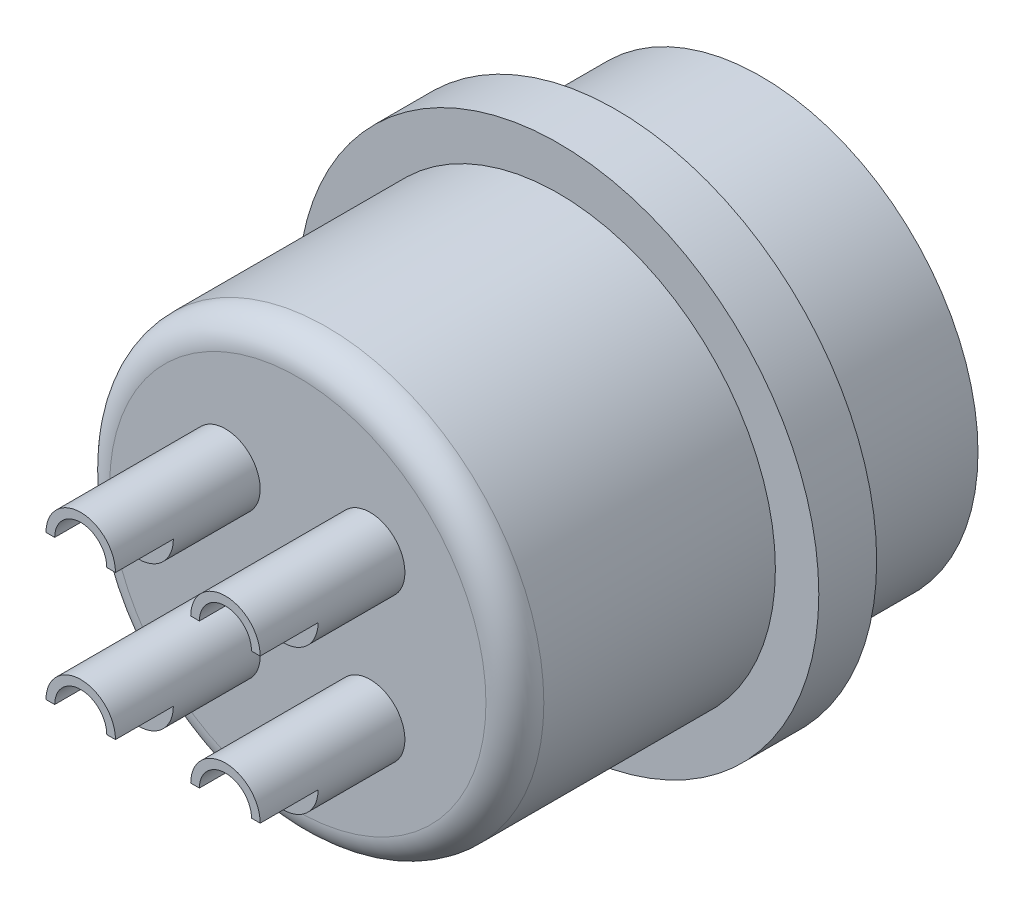
ISO-10303-21;
HEADER;
FILE_DESCRIPTION(('STEP AP214'),'2;1');
FILE_NAME('part.step','',(''),(''),'','','');
FILE_SCHEMA(('AUTOMOTIVE_DESIGN { 1 0 10303 214 1 1 1 1 }'));
ENDSEC;
DATA;
#1=APPLICATION_CONTEXT('core data for automotive mechanical design processes');
#2=APPLICATION_PROTOCOL_DEFINITION('international standard','automotive_design',2000,#1);
#3=PRODUCT_CONTEXT('',#1,'mechanical');
#4=PRODUCT('Part','Part','',(#3));
#5=PRODUCT_RELATED_PRODUCT_CATEGORY('part','',(#4));
#6=PRODUCT_DEFINITION_FORMATION('','',#4);
#7=PRODUCT_DEFINITION_CONTEXT('part definition',#1,'design');
#8=PRODUCT_DEFINITION('design','',#6,#7);
#9=PRODUCT_DEFINITION_SHAPE('','',#8);
#10=(LENGTH_UNIT() NAMED_UNIT(*) SI_UNIT(.MILLI.,.METRE.));
#11=(NAMED_UNIT(*) PLANE_ANGLE_UNIT() SI_UNIT($,.RADIAN.));
#12=(NAMED_UNIT(*) SI_UNIT($,.STERADIAN.) SOLID_ANGLE_UNIT());
#13=UNCERTAINTY_MEASURE_WITH_UNIT(LENGTH_MEASURE(1.E-05),#10,'distance_accuracy_value','');
#14=(GEOMETRIC_REPRESENTATION_CONTEXT(3) GLOBAL_UNCERTAINTY_ASSIGNED_CONTEXT((#13)) GLOBAL_UNIT_ASSIGNED_CONTEXT((#10,
#11,#12)) REPRESENTATION_CONTEXT('',''));
#15=CARTESIAN_POINT('',(0.,0.,0.));
#16=DIRECTION('',(0.,0.,1.));
#17=DIRECTION('',(1.,0.,0.));
#18=AXIS2_PLACEMENT_3D('',#15,#16,#17);
#19=CARTESIAN_POINT('',(0.,0.,5.));
#20=DIRECTION('',(0.,0.,-1.));
#21=DIRECTION('',(-1.,0.,0.));
#22=AXIS2_PLACEMENT_3D('',#19,#20,#21);
#23=CYLINDRICAL_SURFACE('',#22,7.5);
#24=CARTESIAN_POINT('',(0.,0.,5.));
#25=DIRECTION('',(0.,0.,1.));
#26=DIRECTION('',(1.,0.,0.));
#27=AXIS2_PLACEMENT_3D('',#24,#25,#26);
#28=CIRCLE('',#27,7.5);
#29=CARTESIAN_POINT('',(7.5,0.,5.));
#30=VERTEX_POINT('',#29);
#31=EDGE_CURVE('E314',#30,#30,#28,.T.);
#32=ORIENTED_EDGE('',*,*,#31,.F.);
#33=EDGE_LOOP('',(#32));
#34=FACE_BOUND('',#33,.T.);
#35=CARTESIAN_POINT('',(0.,0.,0.));
#36=DIRECTION('',(0.,0.,1.));
#37=DIRECTION('',(1.,0.,0.));
#38=AXIS2_PLACEMENT_3D('',#35,#36,#37);
#39=CIRCLE('',#38,7.5);
#40=CARTESIAN_POINT('',(7.5,0.,0.));
#41=VERTEX_POINT('',#40);
#42=EDGE_CURVE('E311',#41,#41,#39,.T.);
#43=ORIENTED_EDGE('',*,*,#42,.T.);
#44=EDGE_LOOP('',(#43));
#45=FACE_BOUND('',#44,.T.);
#46=ADVANCED_FACE('F36',(#34,#45),#23,.T.);
#47=CARTESIAN_POINT('',(0.,0.,0.));
#48=DIRECTION('',(0.,0.,1.));
#49=DIRECTION('',(1.,0.,0.));
#50=AXIS2_PLACEMENT_3D('',#47,#48,#49);
#51=PLANE('',#50);
#52=CARTESIAN_POINT('',(0.,0.,0.));
#53=DIRECTION('',(0.,0.,-1.));
#54=DIRECTION('',(-1.,0.,0.));
#55=AXIS2_PLACEMENT_3D('',#52,#53,#54);
#56=CIRCLE('',#55,6.5);
#57=CARTESIAN_POINT('',(-0.997037030524288,-6.42307692307692,0.));
#58=VERTEX_POINT('',#57);
#59=CARTESIAN_POINT('',(0.99703703052429,-6.42307692307692,0.));
#60=VERTEX_POINT('',#59);
#61=EDGE_CURVE('E293',#58,#60,#56,.T.);
#62=ORIENTED_EDGE('',*,*,#61,.F.);
#63=CARTESIAN_POINT('',(0.,-6.5,0.));
#64=DIRECTION('',(0.,0.,1.));
#65=DIRECTION('',(-1.,0.,0.));
#66=AXIS2_PLACEMENT_3D('',#63,#64,#65);
#67=CIRCLE('',#66,1.);
#68=EDGE_CURVE('E284',#60,#58,#67,.T.);
#69=ORIENTED_EDGE('',*,*,#68,.F.);
#70=EDGE_LOOP('',(#62,#69));
#71=FACE_BOUND('',#70,.T.);
#72=ORIENTED_EDGE('',*,*,#42,.F.);
#73=EDGE_LOOP('',(#72));
#74=FACE_BOUND('',#73,.T.);
#75=ADVANCED_FACE('F383',(#71,#74),#51,.F.);
#76=CARTESIAN_POINT('',(0.,0.,7.));
#77=DIRECTION('',(0.,0.,-1.));
#78=DIRECTION('',(-1.,0.,0.));
#79=AXIS2_PLACEMENT_3D('',#76,#77,#78);
#80=CYLINDRICAL_SURFACE('',#79,9.);
#81=CARTESIAN_POINT('',(0.,0.,7.));
#82=DIRECTION('',(0.,0.,1.));
#83=DIRECTION('',(1.,0.,0.));
#84=AXIS2_PLACEMENT_3D('',#81,#82,#83);
#85=CIRCLE('',#84,9.);
#86=CARTESIAN_POINT('',(9.,0.,7.));
#87=VERTEX_POINT('',#86);
#88=EDGE_CURVE('E308',#87,#87,#85,.T.);
#89=ORIENTED_EDGE('',*,*,#88,.F.);
#90=EDGE_LOOP('',(#89));
#91=FACE_BOUND('',#90,.T.);
#92=CARTESIAN_POINT('',(0.,0.,5.));
#93=DIRECTION('',(0.,0.,1.));
#94=DIRECTION('',(1.,0.,0.));
#95=AXIS2_PLACEMENT_3D('',#92,#93,#94);
#96=CIRCLE('',#95,9.);
#97=CARTESIAN_POINT('',(9.,0.,5.));
#98=VERTEX_POINT('',#97);
#99=EDGE_CURVE('E307',#98,#98,#96,.T.);
#100=ORIENTED_EDGE('',*,*,#99,.T.);
#101=EDGE_LOOP('',(#100));
#102=FACE_BOUND('',#101,.T.);
#103=ADVANCED_FACE('F389',(#91,#102),#80,.T.);
#104=CARTESIAN_POINT('',(0.,0.,7.));
#105=DIRECTION('',(0.,0.,1.));
#106=DIRECTION('',(1.,0.,0.));
#107=AXIS2_PLACEMENT_3D('',#104,#105,#106);
#108=PLANE('',#107);
#109=CARTESIAN_POINT('',(0.,0.,7.));
#110=DIRECTION('',(0.,0.,1.));
#111=DIRECTION('',(1.,0.,0.));
#112=AXIS2_PLACEMENT_3D('',#109,#110,#111);
#113=CIRCLE('',#112,7.5);
#114=CARTESIAN_POINT('',(7.5,0.,7.));
#115=VERTEX_POINT('',#114);
#116=EDGE_CURVE('E302',#115,#115,#113,.T.);
#117=ORIENTED_EDGE('',*,*,#116,.F.);
#118=EDGE_LOOP('',(#117));
#119=FACE_BOUND('',#118,.T.);
#120=ORIENTED_EDGE('',*,*,#88,.T.);
#121=EDGE_LOOP('',(#120));
#122=FACE_BOUND('',#121,.T.);
#123=ADVANCED_FACE('F450',(#119,#122),#108,.T.);
#124=CARTESIAN_POINT('',(0.,0.,5.));
#125=DIRECTION('',(0.,0.,1.));
#126=DIRECTION('',(1.,0.,0.));
#127=AXIS2_PLACEMENT_3D('',#124,#125,#126);
#128=PLANE('',#127);
#129=ORIENTED_EDGE('',*,*,#31,.T.);
#130=EDGE_LOOP('',(#129));
#131=FACE_BOUND('',#130,.T.);
#132=ORIENTED_EDGE('',*,*,#99,.F.);
#133=EDGE_LOOP('',(#132));
#134=FACE_BOUND('',#133,.T.);
#135=ADVANCED_FACE('F448',(#131,#134),#128,.F.);
#136=CARTESIAN_POINT('',(0.,0.,16.));
#137=DIRECTION('',(0.,0.,-1.));
#138=DIRECTION('',(-1.,0.,0.));
#139=AXIS2_PLACEMENT_3D('',#136,#137,#138);
#140=CYLINDRICAL_SURFACE('',#139,7.5);
#141=CARTESIAN_POINT('',(0.,0.,15.));
#142=DIRECTION('',(0.,0.,1.));
#143=DIRECTION('',(1.,0.,0.));
#144=AXIS2_PLACEMENT_3D('',#141,#142,#143);
#145=CIRCLE('',#144,7.5);
#146=CARTESIAN_POINT('',(7.5,0.,15.));
#147=VERTEX_POINT('',#146);
#148=EDGE_CURVE('E11',#147,#147,#145,.F.);
#149=ORIENTED_EDGE('',*,*,#148,.T.);
#150=EDGE_LOOP('',(#149));
#151=FACE_BOUND('',#150,.T.);
#152=ORIENTED_EDGE('',*,*,#116,.T.);
#153=EDGE_LOOP('',(#152));
#154=FACE_BOUND('',#153,.T.);
#155=ADVANCED_FACE('F443',(#151,#154),#140,.T.);
#156=CARTESIAN_POINT('',(0.,0.,16.));
#157=DIRECTION('',(0.,0.,1.));
#158=DIRECTION('',(1.,0.,0.));
#159=AXIS2_PLACEMENT_3D('',#156,#157,#158);
#160=PLANE('',#159);
#161=CARTESIAN_POINT('',(0.,0.,16.));
#162=DIRECTION('',(0.,0.,1.));
#163=DIRECTION('',(1.,0.,0.));
#164=AXIS2_PLACEMENT_3D('',#161,#162,#163);
#165=CIRCLE('',#164,6.5);
#166=CARTESIAN_POINT('',(6.5,0.,16.));
#167=VERTEX_POINT('',#166);
#168=EDGE_CURVE('E44',#167,#167,#165,.T.);
#169=ORIENTED_EDGE('',*,*,#168,.T.);
#170=EDGE_LOOP('',(#169));
#171=FACE_BOUND('',#170,.T.);
#172=CARTESIAN_POINT('',(2.5,2.5,16.));
#173=DIRECTION('',(0.,0.,1.));
#174=DIRECTION('',(1.,0.,0.));
#175=AXIS2_PLACEMENT_3D('',#172,#173,#174);
#176=CIRCLE('',#175,1.2);
#177=CARTESIAN_POINT('',(3.7,2.5,16.));
#178=VERTEX_POINT('',#177);
#179=EDGE_CURVE('E263',#178,#178,#176,.T.);
#180=ORIENTED_EDGE('',*,*,#179,.F.);
#181=EDGE_LOOP('',(#180));
#182=FACE_BOUND('',#181,.T.);
#183=CARTESIAN_POINT('',(2.5,-2.5,16.));
#184=DIRECTION('',(0.,0.,1.));
#185=DIRECTION('',(1.,0.,0.));
#186=AXIS2_PLACEMENT_3D('',#183,#184,#185);
#187=CIRCLE('',#186,1.2);
#188=CARTESIAN_POINT('',(3.7,-2.5,16.));
#189=VERTEX_POINT('',#188);
#190=EDGE_CURVE('E271',#189,#189,#187,.T.);
#191=ORIENTED_EDGE('',*,*,#190,.F.);
#192=EDGE_LOOP('',(#191));
#193=FACE_BOUND('',#192,.T.);
#194=CARTESIAN_POINT('',(-2.5,-2.5,16.));
#195=DIRECTION('',(0.,0.,1.));
#196=DIRECTION('',(1.,0.,0.));
#197=AXIS2_PLACEMENT_3D('',#194,#195,#196);
#198=CIRCLE('',#197,1.2);
#199=CARTESIAN_POINT('',(-1.3,-2.5,16.));
#200=VERTEX_POINT('',#199);
#201=EDGE_CURVE('E278',#200,#200,#198,.T.);
#202=ORIENTED_EDGE('',*,*,#201,.F.);
#203=EDGE_LOOP('',(#202));
#204=FACE_BOUND('',#203,.T.);
#205=CARTESIAN_POINT('',(-2.5,2.5,16.));
#206=DIRECTION('',(0.,0.,1.));
#207=DIRECTION('',(1.,0.,0.));
#208=AXIS2_PLACEMENT_3D('',#205,#206,#207);
#209=CIRCLE('',#208,1.2);
#210=CARTESIAN_POINT('',(-1.3,2.5,16.));
#211=VERTEX_POINT('',#210);
#212=EDGE_CURVE('E285',#211,#211,#209,.T.);
#213=ORIENTED_EDGE('',*,*,#212,.F.);
#214=EDGE_LOOP('',(#213));
#215=FACE_BOUND('',#214,.T.);
#216=ADVANCED_FACE('F370',(#171,#182,#193,#204,#215),#160,.T.);
#217=CARTESIAN_POINT('',(0.,-6.5,10.));
#218=DIRECTION('',(0.,0.,-1.));
#219=DIRECTION('',(-1.,0.,0.));
#220=AXIS2_PLACEMENT_3D('',#217,#218,#219);
#221=CYLINDRICAL_SURFACE('',#220,1.);
#222=ORIENTED_EDGE('',*,*,#68,.T.);
#223=DIRECTION('',(0.,0.,-1.));
#224=VECTOR('',#223,1.);
#225=CARTESIAN_POINT('',(-0.997037030524288,-6.42307692307692,10.));
#226=LINE('',#225,#224);
#227=CARTESIAN_POINT('',(-0.997037030524288,-6.42307692307692,10.));
#228=VERTEX_POINT('',#227);
#229=EDGE_CURVE('E296',#228,#58,#226,.T.);
#230=ORIENTED_EDGE('',*,*,#229,.F.);
#231=CARTESIAN_POINT('',(0.,-6.5,10.));
#232=DIRECTION('',(0.,0.,1.));
#233=DIRECTION('',(-1.,0.,0.));
#234=AXIS2_PLACEMENT_3D('',#231,#232,#233);
#235=CIRCLE('',#234,1.);
#236=CARTESIAN_POINT('',(0.99703703052429,-6.42307692307692,10.));
#237=VERTEX_POINT('',#236);
#238=EDGE_CURVE('E289',#237,#228,#235,.T.);
#239=ORIENTED_EDGE('',*,*,#238,.F.);
#240=DIRECTION('',(0.,0.,-1.));
#241=VECTOR('',#240,1.);
#242=CARTESIAN_POINT('',(0.99703703052429,-6.42307692307692,10.));
#243=LINE('',#242,#241);
#244=EDGE_CURVE('E300',#237,#60,#243,.T.);
#245=ORIENTED_EDGE('',*,*,#244,.T.);
#246=EDGE_LOOP('',(#222,#230,#239,#245));
#247=FACE_BOUND('',#246,.T.);
#248=ADVANCED_FACE('F433',(#247),#221,.T.);
#249=CARTESIAN_POINT('',(0.,0.,10.));
#250=DIRECTION('',(0.,0.,-1.));
#251=DIRECTION('',(-1.,0.,0.));
#252=AXIS2_PLACEMENT_3D('',#249,#250,#251);
#253=CYLINDRICAL_SURFACE('',#252,6.5);
#254=ORIENTED_EDGE('',*,*,#61,.T.);
#255=ORIENTED_EDGE('',*,*,#244,.F.);
#256=CARTESIAN_POINT('',(0.,0.,10.));
#257=DIRECTION('',(0.,0.,-1.));
#258=DIRECTION('',(-1.,0.,0.));
#259=AXIS2_PLACEMENT_3D('',#256,#257,#258);
#260=CIRCLE('',#259,6.5);
#261=EDGE_CURVE('E292',#228,#237,#260,.T.);
#262=ORIENTED_EDGE('',*,*,#261,.F.);
#263=ORIENTED_EDGE('',*,*,#229,.T.);
#264=EDGE_LOOP('',(#254,#255,#262,#263));
#265=FACE_BOUND('',#264,.T.);
#266=ADVANCED_FACE('F424',(#265),#253,.F.);
#267=CARTESIAN_POINT('',(0.,-3.25,10.));
#268=DIRECTION('',(0.,0.,-1.));
#269=DIRECTION('',(-1.,0.,0.));
#270=AXIS2_PLACEMENT_3D('',#267,#268,#269);
#271=PLANE('',#270);
#272=CARTESIAN_POINT('',(2.5,2.5,10.));
#273=DIRECTION('',(0.,0.,-1.));
#274=DIRECTION('',(-1.,0.,0.));
#275=AXIS2_PLACEMENT_3D('',#272,#273,#274);
#276=CIRCLE('',#275,1.2);
#277=CARTESIAN_POINT('',(1.3,2.5,10.));
#278=VERTEX_POINT('',#277);
#279=EDGE_CURVE('E267',#278,#278,#276,.T.);
#280=ORIENTED_EDGE('',*,*,#279,.F.);
#281=EDGE_LOOP('',(#280));
#282=FACE_BOUND('',#281,.T.);
#283=CARTESIAN_POINT('',(2.5,-2.5,10.));
#284=DIRECTION('',(0.,0.,-1.));
#285=DIRECTION('',(-1.,0.,0.));
#286=AXIS2_PLACEMENT_3D('',#283,#284,#285);
#287=CIRCLE('',#286,1.2);
#288=CARTESIAN_POINT('',(1.3,-2.5,10.));
#289=VERTEX_POINT('',#288);
#290=EDGE_CURVE('E274',#289,#289,#287,.T.);
#291=ORIENTED_EDGE('',*,*,#290,.F.);
#292=EDGE_LOOP('',(#291));
#293=FACE_BOUND('',#292,.T.);
#294=CARTESIAN_POINT('',(-2.5,-2.5,10.));
#295=DIRECTION('',(0.,0.,-1.));
#296=DIRECTION('',(-1.,0.,0.));
#297=AXIS2_PLACEMENT_3D('',#294,#295,#296);
#298=CIRCLE('',#297,1.2);
#299=CARTESIAN_POINT('',(-3.7,-2.5,10.));
#300=VERTEX_POINT('',#299);
#301=EDGE_CURVE('E281',#300,#300,#298,.T.);
#302=ORIENTED_EDGE('',*,*,#301,.F.);
#303=EDGE_LOOP('',(#302));
#304=FACE_BOUND('',#303,.T.);
#305=CARTESIAN_POINT('',(-2.5,2.5,10.));
#306=DIRECTION('',(0.,0.,-1.));
#307=DIRECTION('',(-1.,0.,0.));
#308=AXIS2_PLACEMENT_3D('',#305,#306,#307);
#309=CIRCLE('',#308,1.2);
#310=CARTESIAN_POINT('',(-3.7,2.5,10.));
#311=VERTEX_POINT('',#310);
#312=EDGE_CURVE('E288',#311,#311,#309,.T.);
#313=ORIENTED_EDGE('',*,*,#312,.F.);
#314=EDGE_LOOP('',(#313));
#315=FACE_BOUND('',#314,.T.);
#316=ORIENTED_EDGE('',*,*,#238,.T.);
#317=ORIENTED_EDGE('',*,*,#261,.T.);
#318=EDGE_LOOP('',(#316,#317));
#319=FACE_BOUND('',#318,.T.);
#320=ADVANCED_FACE('F421',(#282,#293,#304,#315,#319),#271,.T.);
#321=CARTESIAN_POINT('',(-2.5,2.5,2.));
#322=DIRECTION('',(0.,0.,1.));
#323=DIRECTION('',(1.,0.,0.));
#324=AXIS2_PLACEMENT_3D('',#321,#322,#323);
#325=PLANE('',#324);
#326=CARTESIAN_POINT('',(-2.5,2.5,2.));
#327=DIRECTION('',(0.,0.,1.));
#328=DIRECTION('',(1.,0.,0.));
#329=AXIS2_PLACEMENT_3D('',#326,#327,#328);
#330=CIRCLE('',#329,0.2);
#331=CARTESIAN_POINT('',(-2.3,2.5,2.));
#332=VERTEX_POINT('',#331);
#333=EDGE_CURVE('E359',#332,#332,#330,.F.);
#334=ORIENTED_EDGE('',*,*,#333,.T.);
#335=EDGE_LOOP('',(#334));
#336=FACE_BOUND('',#335,.T.);
#337=ADVANCED_FACE('F417',(#336),#325,.F.);
#338=CARTESIAN_POINT('',(-2.5,2.5,2.));
#339=DIRECTION('',(0.,0.,1.));
#340=DIRECTION('',(1.,0.,0.));
#341=AXIS2_PLACEMENT_3D('',#338,#339,#340);
#342=CYLINDRICAL_SURFACE('',#341,1.2);
#343=CARTESIAN_POINT('',(-2.5,2.5,3.));
#344=DIRECTION('',(0.,0.,1.));
#345=DIRECTION('',(1.,0.,0.));
#346=AXIS2_PLACEMENT_3D('',#343,#344,#345);
#347=CIRCLE('',#346,1.2);
#348=CARTESIAN_POINT('',(-1.3,2.5,3.));
#349=VERTEX_POINT('',#348);
#350=EDGE_CURVE('E356',#349,#349,#347,.T.);
#351=ORIENTED_EDGE('',*,*,#350,.T.);
#352=EDGE_LOOP('',(#351));
#353=FACE_BOUND('',#352,.T.);
#354=ORIENTED_EDGE('',*,*,#312,.T.);
#355=EDGE_LOOP('',(#354));
#356=FACE_BOUND('',#355,.T.);
#357=ADVANCED_FACE('F413',(#353,#356),#342,.T.);
#358=DIRECTION('',(0.,0.,1.));
#359=VECTOR('',#358,1.);
#360=CARTESIAN_POINT('',(-3.7,2.5,2.));
#361=LINE('',#360,#359);
#362=CARTESIAN_POINT('',(-3.7,2.5,21.));
#363=VERTEX_POINT('',#362);
#364=CARTESIAN_POINT('',(-3.7,2.5,19.));
#365=VERTEX_POINT('',#364);
#366=EDGE_CURVE('E257',#363,#365,#361,.F.);
#367=ORIENTED_EDGE('',*,*,#366,.F.);
#368=CARTESIAN_POINT('',(-2.5,2.5,21.));
#369=DIRECTION('',(0.,0.,1.));
#370=DIRECTION('',(1.,0.,0.));
#371=AXIS2_PLACEMENT_3D('',#368,#369,#370);
#372=CIRCLE('',#371,1.2);
#373=CARTESIAN_POINT('',(-1.3,2.5,21.));
#374=VERTEX_POINT('',#373);
#375=EDGE_CURVE('E277',#374,#363,#372,.T.);
#376=ORIENTED_EDGE('',*,*,#375,.F.);
#377=DIRECTION('',(0.,0.,1.));
#378=VECTOR('',#377,1.);
#379=CARTESIAN_POINT('',(-1.3,2.5,2.));
#380=LINE('',#379,#378);
#381=CARTESIAN_POINT('',(-1.3,2.5,19.));
#382=VERTEX_POINT('',#381);
#383=EDGE_CURVE('E253',#382,#374,#380,.T.);
#384=ORIENTED_EDGE('',*,*,#383,.F.);
#385=CARTESIAN_POINT('',(-2.5,2.5,19.));
#386=DIRECTION('',(0.,0.,1.));
#387=DIRECTION('',(1.,0.,0.));
#388=AXIS2_PLACEMENT_3D('',#385,#386,#387);
#389=CIRCLE('',#388,1.2);
#390=EDGE_CURVE('E328',#382,#365,#389,.F.);
#391=ORIENTED_EDGE('',*,*,#390,.T.);
#392=EDGE_LOOP('',(#367,#376,#384,#391));
#393=FACE_BOUND('',#392,.T.);
#394=ORIENTED_EDGE('',*,*,#212,.T.);
#395=EDGE_LOOP('',(#394));
#396=FACE_BOUND('',#395,.T.);
#397=ADVANCED_FACE('F416',(#393,#396),#342,.T.);
#398=CARTESIAN_POINT('',(-2.5,2.5,21.));
#399=DIRECTION('',(0.,0.,1.));
#400=DIRECTION('',(1.,0.,0.));
#401=AXIS2_PLACEMENT_3D('',#398,#399,#400);
#402=PLANE('',#401);
#403=DIRECTION('',(-1.,0.,0.));
#404=VECTOR('',#403,1.);
#405=CARTESIAN_POINT('',(-4.06563827166861,2.5,21.));
#406=LINE('',#405,#404);
#407=CARTESIAN_POINT('',(-3.4,2.5,21.));
#408=VERTEX_POINT('',#407);
#409=EDGE_CURVE('E241',#408,#363,#406,.T.);
#410=ORIENTED_EDGE('',*,*,#409,.F.);
#411=CARTESIAN_POINT('',(-2.5,2.5,21.));
#412=DIRECTION('',(0.,0.,1.));
#413=DIRECTION('',(1.,0.,0.));
#414=AXIS2_PLACEMENT_3D('',#411,#412,#413);
#415=CIRCLE('',#414,0.9);
#416=CARTESIAN_POINT('',(-1.6,2.5,21.));
#417=VERTEX_POINT('',#416);
#418=EDGE_CURVE('E237',#417,#408,#415,.T.);
#419=ORIENTED_EDGE('',*,*,#418,.F.);
#420=DIRECTION('',(-1.,0.,0.));
#421=VECTOR('',#420,1.);
#422=CARTESIAN_POINT('',(-2.5,2.5,21.));
#423=LINE('',#422,#421);
#424=EDGE_CURVE('E266',#374,#417,#423,.T.);
#425=ORIENTED_EDGE('',*,*,#424,.F.);
#426=ORIENTED_EDGE('',*,*,#375,.T.);
#427=EDGE_LOOP('',(#410,#419,#425,#426));
#428=FACE_BOUND('',#427,.T.);
#429=ADVANCED_FACE('F539',(#428),#402,.T.);
#430=CARTESIAN_POINT('',(-2.5,-2.5,2.));
#431=DIRECTION('',(0.,0.,1.));
#432=DIRECTION('',(1.,0.,0.));
#433=AXIS2_PLACEMENT_3D('',#430,#431,#432);
#434=PLANE('',#433);
#435=CARTESIAN_POINT('',(-2.5,-2.5,2.));
#436=DIRECTION('',(0.,0.,1.));
#437=DIRECTION('',(1.,0.,0.));
#438=AXIS2_PLACEMENT_3D('',#435,#436,#437);
#439=CIRCLE('',#438,0.2);
#440=CARTESIAN_POINT('',(-2.3,-2.5,2.));
#441=VERTEX_POINT('',#440);
#442=EDGE_CURVE('E353',#441,#441,#439,.F.);
#443=ORIENTED_EDGE('',*,*,#442,.T.);
#444=EDGE_LOOP('',(#443));
#445=FACE_BOUND('',#444,.T.);
#446=ADVANCED_FACE('F526',(#445),#434,.F.);
#447=CARTESIAN_POINT('',(-2.5,-2.5,2.));
#448=DIRECTION('',(0.,0.,1.));
#449=DIRECTION('',(1.,0.,0.));
#450=AXIS2_PLACEMENT_3D('',#447,#448,#449);
#451=CYLINDRICAL_SURFACE('',#450,1.2);
#452=CARTESIAN_POINT('',(-2.5,-2.5,3.));
#453=DIRECTION('',(0.,0.,1.));
#454=DIRECTION('',(1.,0.,0.));
#455=AXIS2_PLACEMENT_3D('',#452,#453,#454);
#456=CIRCLE('',#455,1.2);
#457=CARTESIAN_POINT('',(-1.3,-2.5,3.));
#458=VERTEX_POINT('',#457);
#459=EDGE_CURVE('E350',#458,#458,#456,.T.);
#460=ORIENTED_EDGE('',*,*,#459,.T.);
#461=EDGE_LOOP('',(#460));
#462=FACE_BOUND('',#461,.T.);
#463=ORIENTED_EDGE('',*,*,#301,.T.);
#464=EDGE_LOOP('',(#463));
#465=FACE_BOUND('',#464,.T.);
#466=ADVANCED_FACE('F520',(#462,#465),#451,.T.);
#467=DIRECTION('',(0.,0.,1.));
#468=VECTOR('',#467,1.);
#469=CARTESIAN_POINT('',(-3.7,-2.5,2.));
#470=LINE('',#469,#468);
#471=CARTESIAN_POINT('',(-3.7,-2.5,21.));
#472=VERTEX_POINT('',#471);
#473=CARTESIAN_POINT('',(-3.7,-2.5,19.));
#474=VERTEX_POINT('',#473);
#475=EDGE_CURVE('E235',#472,#474,#470,.F.);
#476=ORIENTED_EDGE('',*,*,#475,.F.);
#477=CARTESIAN_POINT('',(-2.5,-2.5,21.));
#478=DIRECTION('',(0.,0.,1.));
#479=DIRECTION('',(1.,0.,0.));
#480=AXIS2_PLACEMENT_3D('',#477,#478,#479);
#481=CIRCLE('',#480,1.2);
#482=CARTESIAN_POINT('',(-1.3,-2.5,21.));
#483=VERTEX_POINT('',#482);
#484=EDGE_CURVE('E270',#483,#472,#481,.T.);
#485=ORIENTED_EDGE('',*,*,#484,.F.);
#486=DIRECTION('',(0.,0.,1.));
#487=VECTOR('',#486,1.);
#488=CARTESIAN_POINT('',(-1.3,-2.5,2.));
#489=LINE('',#488,#487);
#490=CARTESIAN_POINT('',(-1.3,-2.5,19.));
#491=VERTEX_POINT('',#490);
#492=EDGE_CURVE('E51',#491,#483,#489,.T.);
#493=ORIENTED_EDGE('',*,*,#492,.F.);
#494=CARTESIAN_POINT('',(-2.5,-2.5,19.));
#495=DIRECTION('',(0.,0.,1.));
#496=DIRECTION('',(1.,0.,0.));
#497=AXIS2_PLACEMENT_3D('',#494,#495,#496);
#498=CIRCLE('',#497,1.2);
#499=EDGE_CURVE('E341',#491,#474,#498,.F.);
#500=ORIENTED_EDGE('',*,*,#499,.T.);
#501=EDGE_LOOP('',(#476,#485,#493,#500));
#502=FACE_BOUND('',#501,.T.);
#503=ORIENTED_EDGE('',*,*,#201,.T.);
#504=EDGE_LOOP('',(#503));
#505=FACE_BOUND('',#504,.T.);
#506=ADVANCED_FACE('F525',(#502,#505),#451,.T.);
#507=CARTESIAN_POINT('',(-2.5,-2.5,21.));
#508=DIRECTION('',(0.,0.,1.));
#509=DIRECTION('',(1.,0.,0.));
#510=AXIS2_PLACEMENT_3D('',#507,#508,#509);
#511=PLANE('',#510);
#512=DIRECTION('',(-1.,0.,0.));
#513=VECTOR('',#512,1.);
#514=CARTESIAN_POINT('',(-4.06563827166861,-2.5,21.));
#515=LINE('',#514,#513);
#516=CARTESIAN_POINT('',(-3.4,-2.5,21.));
#517=VERTEX_POINT('',#516);
#518=EDGE_CURVE('E205',#517,#472,#515,.T.);
#519=ORIENTED_EDGE('',*,*,#518,.F.);
#520=CARTESIAN_POINT('',(-2.5,-2.5,21.));
#521=DIRECTION('',(0.,0.,1.));
#522=DIRECTION('',(1.,0.,0.));
#523=AXIS2_PLACEMENT_3D('',#520,#521,#522);
#524=CIRCLE('',#523,0.9);
#525=CARTESIAN_POINT('',(-1.6,-2.5,21.));
#526=VERTEX_POINT('',#525);
#527=EDGE_CURVE('E199',#526,#517,#524,.T.);
#528=ORIENTED_EDGE('',*,*,#527,.F.);
#529=DIRECTION('',(-1.,0.,0.));
#530=VECTOR('',#529,1.);
#531=CARTESIAN_POINT('',(-2.5,-2.5,21.));
#532=LINE('',#531,#530);
#533=EDGE_CURVE('E339',#483,#526,#532,.T.);
#534=ORIENTED_EDGE('',*,*,#533,.F.);
#535=ORIENTED_EDGE('',*,*,#484,.T.);
#536=EDGE_LOOP('',(#519,#528,#534,#535));
#537=FACE_BOUND('',#536,.T.);
#538=ADVANCED_FACE('F550',(#537),#511,.T.);
#539=CARTESIAN_POINT('',(2.5,-2.5,2.));
#540=DIRECTION('',(0.,0.,1.));
#541=DIRECTION('',(1.,0.,0.));
#542=AXIS2_PLACEMENT_3D('',#539,#540,#541);
#543=PLANE('',#542);
#544=CARTESIAN_POINT('',(2.5,-2.5,2.));
#545=DIRECTION('',(0.,0.,1.));
#546=DIRECTION('',(1.,0.,0.));
#547=AXIS2_PLACEMENT_3D('',#544,#545,#546);
#548=CIRCLE('',#547,0.199999999999999);
#549=CARTESIAN_POINT('',(2.7,-2.5,2.));
#550=VERTEX_POINT('',#549);
#551=EDGE_CURVE('E347',#550,#550,#548,.F.);
#552=ORIENTED_EDGE('',*,*,#551,.T.);
#553=EDGE_LOOP('',(#552));
#554=FACE_BOUND('',#553,.T.);
#555=ADVANCED_FACE('F511',(#554),#543,.F.);
#556=CARTESIAN_POINT('',(2.5,-2.5,2.));
#557=DIRECTION('',(0.,0.,1.));
#558=DIRECTION('',(1.,0.,0.));
#559=AXIS2_PLACEMENT_3D('',#556,#557,#558);
#560=CYLINDRICAL_SURFACE('',#559,1.2);
#561=CARTESIAN_POINT('',(2.5,-2.5,3.));
#562=DIRECTION('',(0.,0.,1.));
#563=DIRECTION('',(1.,0.,0.));
#564=AXIS2_PLACEMENT_3D('',#561,#562,#563);
#565=CIRCLE('',#564,1.2);
#566=CARTESIAN_POINT('',(3.7,-2.5,3.));
#567=VERTEX_POINT('',#566);
#568=EDGE_CURVE('E344',#567,#567,#565,.T.);
#569=ORIENTED_EDGE('',*,*,#568,.T.);
#570=EDGE_LOOP('',(#569));
#571=FACE_BOUND('',#570,.T.);
#572=ORIENTED_EDGE('',*,*,#290,.T.);
#573=EDGE_LOOP('',(#572));
#574=FACE_BOUND('',#573,.T.);
#575=ADVANCED_FACE('F505',(#571,#574),#560,.T.);
#576=DIRECTION('',(0.,0.,1.));
#577=VECTOR('',#576,1.);
#578=CARTESIAN_POINT('',(3.7,-2.5,2.));
#579=LINE('',#578,#577);
#580=CARTESIAN_POINT('',(3.7,-2.5,19.));
#581=VERTEX_POINT('',#580);
#582=CARTESIAN_POINT('',(3.7,-2.5,21.));
#583=VERTEX_POINT('',#582);
#584=EDGE_CURVE('E232',#581,#583,#579,.T.);
#585=ORIENTED_EDGE('',*,*,#584,.F.);
#586=CARTESIAN_POINT('',(2.5,-2.5,19.));
#587=DIRECTION('',(0.,0.,-1.));
#588=DIRECTION('',(-1.,0.,0.));
#589=AXIS2_PLACEMENT_3D('',#586,#587,#588);
#590=CIRCLE('',#589,1.2);
#591=CARTESIAN_POINT('',(1.3,-2.5,19.));
#592=VERTEX_POINT('',#591);
#593=EDGE_CURVE('E337',#592,#581,#590,.F.);
#594=ORIENTED_EDGE('',*,*,#593,.F.);
#595=DIRECTION('',(0.,0.,1.));
#596=VECTOR('',#595,1.);
#597=CARTESIAN_POINT('',(1.3,-2.5,2.));
#598=LINE('',#597,#596);
#599=CARTESIAN_POINT('',(1.3,-2.5,21.));
#600=VERTEX_POINT('',#599);
#601=EDGE_CURVE('E230',#600,#592,#598,.F.);
#602=ORIENTED_EDGE('',*,*,#601,.F.);
#603=CARTESIAN_POINT('',(2.5,-2.5,21.));
#604=DIRECTION('',(0.,0.,1.));
#605=DIRECTION('',(1.,0.,0.));
#606=AXIS2_PLACEMENT_3D('',#603,#604,#605);
#607=CIRCLE('',#606,1.2);
#608=EDGE_CURVE('E262',#583,#600,#607,.T.);
#609=ORIENTED_EDGE('',*,*,#608,.F.);
#610=EDGE_LOOP('',(#585,#594,#602,#609));
#611=FACE_BOUND('',#610,.T.);
#612=ORIENTED_EDGE('',*,*,#190,.T.);
#613=EDGE_LOOP('',(#612));
#614=FACE_BOUND('',#613,.T.);
#615=ADVANCED_FACE('F510',(#611,#614),#560,.T.);
#616=CARTESIAN_POINT('',(2.5,-2.5,21.));
#617=DIRECTION('',(0.,0.,1.));
#618=DIRECTION('',(1.,0.,0.));
#619=AXIS2_PLACEMENT_3D('',#616,#617,#618);
#620=PLANE('',#619);
#621=DIRECTION('',(-1.,0.,0.));
#622=VECTOR('',#621,1.);
#623=CARTESIAN_POINT('',(2.5,-2.5,21.));
#624=LINE('',#623,#622);
#625=CARTESIAN_POINT('',(3.4,-2.5,21.));
#626=VERTEX_POINT('',#625);
#627=EDGE_CURVE('E335',#583,#626,#624,.T.);
#628=ORIENTED_EDGE('',*,*,#627,.F.);
#629=ORIENTED_EDGE('',*,*,#608,.T.);
#630=DIRECTION('',(-1.,0.,0.));
#631=VECTOR('',#630,1.);
#632=CARTESIAN_POINT('',(1.6,-2.5,21.));
#633=LINE('',#632,#631);
#634=CARTESIAN_POINT('',(1.6,-2.5,21.));
#635=VERTEX_POINT('',#634);
#636=EDGE_CURVE('E217',#635,#600,#633,.T.);
#637=ORIENTED_EDGE('',*,*,#636,.F.);
#638=CARTESIAN_POINT('',(2.5,-2.5,21.));
#639=DIRECTION('',(0.,0.,1.));
#640=DIRECTION('',(-1.,0.,0.));
#641=AXIS2_PLACEMENT_3D('',#638,#639,#640);
#642=CIRCLE('',#641,0.9);
#643=EDGE_CURVE('E59',#626,#635,#642,.T.);
#644=ORIENTED_EDGE('',*,*,#643,.F.);
#645=EDGE_LOOP('',(#628,#629,#637,#644));
#646=FACE_BOUND('',#645,.T.);
#647=ADVANCED_FACE('F560',(#646),#620,.T.);
#648=CARTESIAN_POINT('',(2.5,2.5,2.));
#649=DIRECTION('',(0.,0.,1.));
#650=DIRECTION('',(1.,0.,0.));
#651=AXIS2_PLACEMENT_3D('',#648,#649,#650);
#652=PLANE('',#651);
#653=CARTESIAN_POINT('',(2.5,2.5,2.));
#654=DIRECTION('',(0.,0.,1.));
#655=DIRECTION('',(1.,0.,0.));
#656=AXIS2_PLACEMENT_3D('',#653,#654,#655);
#657=CIRCLE('',#656,0.199999999999999);
#658=CARTESIAN_POINT('',(2.7,2.5,2.));
#659=VERTEX_POINT('',#658);
#660=EDGE_CURVE('E365',#659,#659,#657,.F.);
#661=ORIENTED_EDGE('',*,*,#660,.T.);
#662=EDGE_LOOP('',(#661));
#663=FACE_BOUND('',#662,.T.);
#664=ADVANCED_FACE('F495',(#663),#652,.F.);
#665=CARTESIAN_POINT('',(2.5,2.5,2.));
#666=DIRECTION('',(0.,0.,1.));
#667=DIRECTION('',(1.,0.,0.));
#668=AXIS2_PLACEMENT_3D('',#665,#666,#667);
#669=CYLINDRICAL_SURFACE('',#668,1.2);
#670=CARTESIAN_POINT('',(2.5,2.5,3.));
#671=DIRECTION('',(0.,0.,1.));
#672=DIRECTION('',(1.,0.,0.));
#673=AXIS2_PLACEMENT_3D('',#670,#671,#672);
#674=CIRCLE('',#673,1.2);
#675=CARTESIAN_POINT('',(3.7,2.5,3.));
#676=VERTEX_POINT('',#675);
#677=EDGE_CURVE('E362',#676,#676,#674,.T.);
#678=ORIENTED_EDGE('',*,*,#677,.T.);
#679=EDGE_LOOP('',(#678));
#680=FACE_BOUND('',#679,.T.);
#681=ORIENTED_EDGE('',*,*,#279,.T.);
#682=EDGE_LOOP('',(#681));
#683=FACE_BOUND('',#682,.T.);
#684=ADVANCED_FACE('F489',(#680,#683),#669,.T.);
#685=DIRECTION('',(0.,0.,1.));
#686=VECTOR('',#685,1.);
#687=CARTESIAN_POINT('',(3.7,2.5,2.));
#688=LINE('',#687,#686);
#689=CARTESIAN_POINT('',(3.7,2.5,19.));
#690=VERTEX_POINT('',#689);
#691=CARTESIAN_POINT('',(3.7,2.5,21.));
#692=VERTEX_POINT('',#691);
#693=EDGE_CURVE('E228',#690,#692,#688,.T.);
#694=ORIENTED_EDGE('',*,*,#693,.F.);
#695=CARTESIAN_POINT('',(2.5,2.5,19.));
#696=DIRECTION('',(0.,0.,-1.));
#697=DIRECTION('',(-1.,0.,0.));
#698=AXIS2_PLACEMENT_3D('',#695,#696,#697);
#699=CIRCLE('',#698,1.2);
#700=CARTESIAN_POINT('',(1.3,2.5,19.));
#701=VERTEX_POINT('',#700);
#702=EDGE_CURVE('E333',#701,#690,#699,.F.);
#703=ORIENTED_EDGE('',*,*,#702,.F.);
#704=DIRECTION('',(0.,0.,1.));
#705=VECTOR('',#704,1.);
#706=CARTESIAN_POINT('',(1.3,2.5,2.));
#707=LINE('',#706,#705);
#708=CARTESIAN_POINT('',(1.3,2.5,21.));
#709=VERTEX_POINT('',#708);
#710=EDGE_CURVE('E180',#709,#701,#707,.F.);
#711=ORIENTED_EDGE('',*,*,#710,.F.);
#712=CARTESIAN_POINT('',(2.5,2.5,21.));
#713=DIRECTION('',(0.,0.,1.));
#714=DIRECTION('',(1.,0.,0.));
#715=AXIS2_PLACEMENT_3D('',#712,#713,#714);
#716=CIRCLE('',#715,1.2);
#717=EDGE_CURVE('E259',#692,#709,#716,.T.);
#718=ORIENTED_EDGE('',*,*,#717,.F.);
#719=EDGE_LOOP('',(#694,#703,#711,#718));
#720=FACE_BOUND('',#719,.T.);
#721=ORIENTED_EDGE('',*,*,#179,.T.);
#722=EDGE_LOOP('',(#721));
#723=FACE_BOUND('',#722,.T.);
#724=ADVANCED_FACE('F494',(#720,#723),#669,.T.);
#725=CARTESIAN_POINT('',(2.5,2.5,21.));
#726=DIRECTION('',(0.,0.,1.));
#727=DIRECTION('',(1.,0.,0.));
#728=AXIS2_PLACEMENT_3D('',#725,#726,#727);
#729=PLANE('',#728);
#730=DIRECTION('',(-1.,0.,0.));
#731=VECTOR('',#730,1.);
#732=CARTESIAN_POINT('',(2.5,2.5,21.));
#733=LINE('',#732,#731);
#734=CARTESIAN_POINT('',(3.4,2.5,21.));
#735=VERTEX_POINT('',#734);
#736=EDGE_CURVE('E331',#692,#735,#733,.T.);
#737=ORIENTED_EDGE('',*,*,#736,.F.);
#738=ORIENTED_EDGE('',*,*,#717,.T.);
#739=DIRECTION('',(-1.,0.,0.));
#740=VECTOR('',#739,1.);
#741=CARTESIAN_POINT('',(1.6,2.5,21.));
#742=LINE('',#741,#740);
#743=CARTESIAN_POINT('',(1.6,2.5,21.));
#744=VERTEX_POINT('',#743);
#745=EDGE_CURVE('E187',#744,#709,#742,.T.);
#746=ORIENTED_EDGE('',*,*,#745,.F.);
#747=CARTESIAN_POINT('',(2.5,2.5,21.));
#748=DIRECTION('',(0.,0.,1.));
#749=DIRECTION('',(-1.,0.,0.));
#750=AXIS2_PLACEMENT_3D('',#747,#748,#749);
#751=CIRCLE('',#750,0.9);
#752=EDGE_CURVE('E170',#735,#744,#751,.T.);
#753=ORIENTED_EDGE('',*,*,#752,.F.);
#754=EDGE_LOOP('',(#737,#738,#746,#753));
#755=FACE_BOUND('',#754,.T.);
#756=ADVANCED_FACE('F569',(#755),#729,.T.);
#757=CARTESIAN_POINT('',(-4.06563827166861,2.5,19.));
#758=DIRECTION('',(0.,1.,0.));
#759=DIRECTION('',(0.,0.,1.));
#760=AXIS2_PLACEMENT_3D('',#757,#758,#759);
#761=PLANE('',#760);
#762=ORIENTED_EDGE('',*,*,#366,.T.);
#763=DIRECTION('',(-1.,0.,0.));
#764=VECTOR('',#763,1.);
#765=CARTESIAN_POINT('',(-4.06563827166861,2.5,19.));
#766=LINE('',#765,#764);
#767=CARTESIAN_POINT('',(-3.4,2.5,19.));
#768=VERTEX_POINT('',#767);
#769=EDGE_CURVE('E244',#768,#365,#766,.T.);
#770=ORIENTED_EDGE('',*,*,#769,.F.);
#771=DIRECTION('',(0.,0.,1.));
#772=VECTOR('',#771,1.);
#773=CARTESIAN_POINT('',(-3.4,2.5,19.));
#774=LINE('',#773,#772);
#775=EDGE_CURVE('E251',#768,#408,#774,.T.);
#776=ORIENTED_EDGE('',*,*,#775,.T.);
#777=ORIENTED_EDGE('',*,*,#409,.T.);
#778=EDGE_LOOP('',(#762,#770,#776,#777));
#779=FACE_BOUND('',#778,.T.);
#780=ADVANCED_FACE('F641',(#779),#761,.F.);
#781=CARTESIAN_POINT('',(-2.5,2.5,19.));
#782=DIRECTION('',(0.,0.,1.));
#783=DIRECTION('',(1.,0.,0.));
#784=AXIS2_PLACEMENT_3D('',#781,#782,#783);
#785=CYLINDRICAL_SURFACE('',#784,0.9);
#786=ORIENTED_EDGE('',*,*,#418,.T.);
#787=ORIENTED_EDGE('',*,*,#775,.F.);
#788=CARTESIAN_POINT('',(-2.5,2.5,19.));
#789=DIRECTION('',(0.,0.,1.));
#790=DIRECTION('',(1.,0.,0.));
#791=AXIS2_PLACEMENT_3D('',#788,#789,#790);
#792=CIRCLE('',#791,0.9);
#793=CARTESIAN_POINT('',(-1.6,2.5,19.));
#794=VERTEX_POINT('',#793);
#795=EDGE_CURVE('E240',#794,#768,#792,.T.);
#796=ORIENTED_EDGE('',*,*,#795,.F.);
#797=DIRECTION('',(0.,0.,1.));
#798=VECTOR('',#797,1.);
#799=CARTESIAN_POINT('',(-1.6,2.5,19.));
#800=LINE('',#799,#798);
#801=EDGE_CURVE('E247',#794,#417,#800,.T.);
#802=ORIENTED_EDGE('',*,*,#801,.T.);
#803=EDGE_LOOP('',(#786,#787,#796,#802));
#804=FACE_BOUND('',#803,.T.);
#805=ADVANCED_FACE('F698',(#804),#785,.F.);
#806=CARTESIAN_POINT('',(-1.6,2.5,19.));
#807=DIRECTION('',(0.,1.,0.));
#808=DIRECTION('',(0.,0.,1.));
#809=AXIS2_PLACEMENT_3D('',#806,#807,#808);
#810=PLANE('',#809);
#811=ORIENTED_EDGE('',*,*,#383,.T.);
#812=ORIENTED_EDGE('',*,*,#424,.T.);
#813=ORIENTED_EDGE('',*,*,#801,.F.);
#814=DIRECTION('',(-1.,0.,0.));
#815=VECTOR('',#814,1.);
#816=CARTESIAN_POINT('',(-1.6,2.5,19.));
#817=LINE('',#816,#815);
#818=EDGE_CURVE('E238',#382,#794,#817,.T.);
#819=ORIENTED_EDGE('',*,*,#818,.F.);
#820=EDGE_LOOP('',(#811,#812,#813,#819));
#821=FACE_BOUND('',#820,.T.);
#822=ADVANCED_FACE('F688',(#821),#810,.F.);
#823=CARTESIAN_POINT('',(-2.5,2.5,19.));
#824=DIRECTION('',(0.,0.,1.));
#825=DIRECTION('',(1.,0.,0.));
#826=AXIS2_PLACEMENT_3D('',#823,#824,#825);
#827=PLANE('',#826);
#828=ORIENTED_EDGE('',*,*,#818,.T.);
#829=ORIENTED_EDGE('',*,*,#795,.T.);
#830=ORIENTED_EDGE('',*,*,#769,.T.);
#831=ORIENTED_EDGE('',*,*,#390,.F.);
#832=EDGE_LOOP('',(#828,#829,#830,#831));
#833=FACE_BOUND('',#832,.T.);
#834=ADVANCED_FACE('F683',(#833),#827,.T.);
#835=CARTESIAN_POINT('',(2.5,2.5,19.));
#836=DIRECTION('',(0.,0.,1.));
#837=DIRECTION('',(1.,0.,0.));
#838=AXIS2_PLACEMENT_3D('',#835,#836,#837);
#839=CYLINDRICAL_SURFACE('',#838,0.9);
#840=ORIENTED_EDGE('',*,*,#752,.T.);
#841=DIRECTION('',(0.,0.,1.));
#842=VECTOR('',#841,1.);
#843=CARTESIAN_POINT('',(1.6,2.5,19.));
#844=LINE('',#843,#842);
#845=CARTESIAN_POINT('',(1.6,2.5,19.));
#846=VERTEX_POINT('',#845);
#847=EDGE_CURVE('E163',#846,#744,#844,.T.);
#848=ORIENTED_EDGE('',*,*,#847,.F.);
#849=CARTESIAN_POINT('',(2.5,2.5,19.));
#850=DIRECTION('',(0.,0.,1.));
#851=DIRECTION('',(-1.,0.,0.));
#852=AXIS2_PLACEMENT_3D('',#849,#850,#851);
#853=CIRCLE('',#852,0.9);
#854=CARTESIAN_POINT('',(3.4,2.5,19.));
#855=VERTEX_POINT('',#854);
#856=EDGE_CURVE('E168',#855,#846,#853,.T.);
#857=ORIENTED_EDGE('',*,*,#856,.F.);
#858=DIRECTION('',(0.,0.,1.));
#859=VECTOR('',#858,1.);
#860=CARTESIAN_POINT('',(3.4,2.5,19.));
#861=LINE('',#860,#859);
#862=EDGE_CURVE('E173',#855,#735,#861,.T.);
#863=ORIENTED_EDGE('',*,*,#862,.T.);
#864=EDGE_LOOP('',(#840,#848,#857,#863));
#865=FACE_BOUND('',#864,.T.);
#866=ADVANCED_FACE('F165',(#865),#839,.F.);
#867=CARTESIAN_POINT('',(4.06563827166861,2.5,19.));
#868=DIRECTION('',(0.,1.,0.));
#869=DIRECTION('',(0.,0.,1.));
#870=AXIS2_PLACEMENT_3D('',#867,#868,#869);
#871=PLANE('',#870);
#872=ORIENTED_EDGE('',*,*,#693,.T.);
#873=ORIENTED_EDGE('',*,*,#736,.T.);
#874=ORIENTED_EDGE('',*,*,#862,.F.);
#875=DIRECTION('',(-1.,0.,0.));
#876=VECTOR('',#875,1.);
#877=CARTESIAN_POINT('',(4.06563827166861,2.5,19.));
#878=LINE('',#877,#876);
#879=EDGE_CURVE('E174',#690,#855,#878,.T.);
#880=ORIENTED_EDGE('',*,*,#879,.F.);
#881=EDGE_LOOP('',(#872,#873,#874,#880));
#882=FACE_BOUND('',#881,.T.);
#883=ADVANCED_FACE('F755',(#882),#871,.F.);
#884=CARTESIAN_POINT('',(1.6,2.5,19.));
#885=DIRECTION('',(0.,1.,0.));
#886=DIRECTION('',(0.,0.,1.));
#887=AXIS2_PLACEMENT_3D('',#884,#885,#886);
#888=PLANE('',#887);
#889=ORIENTED_EDGE('',*,*,#710,.T.);
#890=DIRECTION('',(-1.,0.,0.));
#891=VECTOR('',#890,1.);
#892=CARTESIAN_POINT('',(1.6,2.5,19.));
#893=LINE('',#892,#891);
#894=EDGE_CURVE('E177',#846,#701,#893,.T.);
#895=ORIENTED_EDGE('',*,*,#894,.F.);
#896=ORIENTED_EDGE('',*,*,#847,.T.);
#897=ORIENTED_EDGE('',*,*,#745,.T.);
#898=EDGE_LOOP('',(#889,#895,#896,#897));
#899=FACE_BOUND('',#898,.T.);
#900=ADVANCED_FACE('F178',(#899),#888,.F.);
#901=CARTESIAN_POINT('',(2.5,2.5,19.));
#902=DIRECTION('',(0.,0.,-1.));
#903=DIRECTION('',(-1.,0.,0.));
#904=AXIS2_PLACEMENT_3D('',#901,#902,#903);
#905=PLANE('',#904);
#906=ORIENTED_EDGE('',*,*,#702,.T.);
#907=ORIENTED_EDGE('',*,*,#879,.T.);
#908=ORIENTED_EDGE('',*,*,#856,.T.);
#909=ORIENTED_EDGE('',*,*,#894,.T.);
#910=EDGE_LOOP('',(#906,#907,#908,#909));
#911=FACE_BOUND('',#910,.T.);
#912=ADVANCED_FACE('F184',(#911),#905,.F.);
#913=CARTESIAN_POINT('',(2.5,-2.5,19.));
#914=DIRECTION('',(0.,0.,1.));
#915=DIRECTION('',(1.,0.,0.));
#916=AXIS2_PLACEMENT_3D('',#913,#914,#915);
#917=CYLINDRICAL_SURFACE('',#916,0.9);
#918=ORIENTED_EDGE('',*,*,#643,.T.);
#919=DIRECTION('',(0.,0.,1.));
#920=VECTOR('',#919,1.);
#921=CARTESIAN_POINT('',(1.6,-2.5,19.));
#922=LINE('',#921,#920);
#923=CARTESIAN_POINT('',(1.6,-2.5,19.));
#924=VERTEX_POINT('',#923);
#925=EDGE_CURVE('E222',#924,#635,#922,.T.);
#926=ORIENTED_EDGE('',*,*,#925,.F.);
#927=CARTESIAN_POINT('',(2.5,-2.5,19.));
#928=DIRECTION('',(0.,0.,1.));
#929=DIRECTION('',(-1.,0.,0.));
#930=AXIS2_PLACEMENT_3D('',#927,#928,#929);
#931=CIRCLE('',#930,0.9);
#932=CARTESIAN_POINT('',(3.4,-2.5,19.));
#933=VERTEX_POINT('',#932);
#934=EDGE_CURVE('E213',#933,#924,#931,.T.);
#935=ORIENTED_EDGE('',*,*,#934,.F.);
#936=DIRECTION('',(0.,0.,1.));
#937=VECTOR('',#936,1.);
#938=CARTESIAN_POINT('',(3.4,-2.5,19.));
#939=LINE('',#938,#937);
#940=EDGE_CURVE('E207',#933,#626,#939,.T.);
#941=ORIENTED_EDGE('',*,*,#940,.T.);
#942=EDGE_LOOP('',(#918,#926,#935,#941));
#943=FACE_BOUND('',#942,.T.);
#944=ADVANCED_FACE('F674',(#943),#917,.F.);
#945=CARTESIAN_POINT('',(4.06563827166861,-2.5,19.));
#946=DIRECTION('',(0.,1.,0.));
#947=DIRECTION('',(0.,0.,1.));
#948=AXIS2_PLACEMENT_3D('',#945,#946,#947);
#949=PLANE('',#948);
#950=ORIENTED_EDGE('',*,*,#584,.T.);
#951=ORIENTED_EDGE('',*,*,#627,.T.);
#952=ORIENTED_EDGE('',*,*,#940,.F.);
#953=DIRECTION('',(-1.,0.,0.));
#954=VECTOR('',#953,1.);
#955=CARTESIAN_POINT('',(4.06563827166861,-2.5,19.));
#956=LINE('',#955,#954);
#957=EDGE_CURVE('E220',#581,#933,#956,.T.);
#958=ORIENTED_EDGE('',*,*,#957,.F.);
#959=EDGE_LOOP('',(#950,#951,#952,#958));
#960=FACE_BOUND('',#959,.T.);
#961=ADVANCED_FACE('F746',(#960),#949,.F.);
#962=CARTESIAN_POINT('',(1.6,-2.5,19.));
#963=DIRECTION('',(0.,1.,0.));
#964=DIRECTION('',(0.,0.,1.));
#965=AXIS2_PLACEMENT_3D('',#962,#963,#964);
#966=PLANE('',#965);
#967=ORIENTED_EDGE('',*,*,#601,.T.);
#968=DIRECTION('',(-1.,0.,0.));
#969=VECTOR('',#968,1.);
#970=CARTESIAN_POINT('',(1.6,-2.5,19.));
#971=LINE('',#970,#969);
#972=EDGE_CURVE('E216',#924,#592,#971,.T.);
#973=ORIENTED_EDGE('',*,*,#972,.F.);
#974=ORIENTED_EDGE('',*,*,#925,.T.);
#975=ORIENTED_EDGE('',*,*,#636,.T.);
#976=EDGE_LOOP('',(#967,#973,#974,#975));
#977=FACE_BOUND('',#976,.T.);
#978=ADVANCED_FACE('F736',(#977),#966,.F.);
#979=CARTESIAN_POINT('',(2.5,-2.5,19.));
#980=DIRECTION('',(0.,0.,-1.));
#981=DIRECTION('',(-1.,0.,0.));
#982=AXIS2_PLACEMENT_3D('',#979,#980,#981);
#983=PLANE('',#982);
#984=ORIENTED_EDGE('',*,*,#593,.T.);
#985=ORIENTED_EDGE('',*,*,#957,.T.);
#986=ORIENTED_EDGE('',*,*,#934,.T.);
#987=ORIENTED_EDGE('',*,*,#972,.T.);
#988=EDGE_LOOP('',(#984,#985,#986,#987));
#989=FACE_BOUND('',#988,.T.);
#990=ADVANCED_FACE('F731',(#989),#983,.F.);
#991=CARTESIAN_POINT('',(-4.06563827166861,-2.5,19.));
#992=DIRECTION('',(0.,1.,0.));
#993=DIRECTION('',(0.,0.,1.));
#994=AXIS2_PLACEMENT_3D('',#991,#992,#993);
#995=PLANE('',#994);
#996=ORIENTED_EDGE('',*,*,#475,.T.);
#997=DIRECTION('',(-1.,0.,0.));
#998=VECTOR('',#997,1.);
#999=CARTESIAN_POINT('',(-4.06563827166861,-2.5,19.));
#1000=LINE('',#999,#998);
#1001=CARTESIAN_POINT('',(-3.4,-2.5,19.));
#1002=VERTEX_POINT('',#1001);
#1003=EDGE_CURVE('E195',#1002,#474,#1000,.T.);
#1004=ORIENTED_EDGE('',*,*,#1003,.F.);
#1005=DIRECTION('',(0.,0.,1.));
#1006=VECTOR('',#1005,1.);
#1007=CARTESIAN_POINT('',(-3.4,-2.5,19.));
#1008=LINE('',#1007,#1006);
#1009=EDGE_CURVE('E192',#1002,#517,#1008,.T.);
#1010=ORIENTED_EDGE('',*,*,#1009,.T.);
#1011=ORIENTED_EDGE('',*,*,#518,.T.);
#1012=EDGE_LOOP('',(#996,#1004,#1010,#1011));
#1013=FACE_BOUND('',#1012,.T.);
#1014=ADVANCED_FACE('F723',(#1013),#995,.F.);
#1015=CARTESIAN_POINT('',(-2.5,-2.5,19.));
#1016=DIRECTION('',(0.,0.,1.));
#1017=DIRECTION('',(1.,0.,0.));
#1018=AXIS2_PLACEMENT_3D('',#1015,#1016,#1017);
#1019=CYLINDRICAL_SURFACE('',#1018,0.9);
#1020=ORIENTED_EDGE('',*,*,#527,.T.);
#1021=ORIENTED_EDGE('',*,*,#1009,.F.);
#1022=CARTESIAN_POINT('',(-2.5,-2.5,19.));
#1023=DIRECTION('',(0.,0.,1.));
#1024=DIRECTION('',(1.,0.,0.));
#1025=AXIS2_PLACEMENT_3D('',#1022,#1023,#1024);
#1026=CIRCLE('',#1025,0.9);
#1027=CARTESIAN_POINT('',(-1.6,-2.5,19.));
#1028=VERTEX_POINT('',#1027);
#1029=EDGE_CURVE('E201',#1028,#1002,#1026,.T.);
#1030=ORIENTED_EDGE('',*,*,#1029,.F.);
#1031=DIRECTION('',(0.,0.,1.));
#1032=VECTOR('',#1031,1.);
#1033=CARTESIAN_POINT('',(-1.6,-2.5,19.));
#1034=LINE('',#1033,#1032);
#1035=EDGE_CURVE('E204',#1028,#526,#1034,.T.);
#1036=ORIENTED_EDGE('',*,*,#1035,.T.);
#1037=EDGE_LOOP('',(#1020,#1021,#1030,#1036));
#1038=FACE_BOUND('',#1037,.T.);
#1039=ADVANCED_FACE('F718',(#1038),#1019,.F.);
#1040=CARTESIAN_POINT('',(-1.6,-2.5,19.));
#1041=DIRECTION('',(0.,1.,0.));
#1042=DIRECTION('',(0.,0.,1.));
#1043=AXIS2_PLACEMENT_3D('',#1040,#1041,#1042);
#1044=PLANE('',#1043);
#1045=ORIENTED_EDGE('',*,*,#492,.T.);
#1046=ORIENTED_EDGE('',*,*,#533,.T.);
#1047=ORIENTED_EDGE('',*,*,#1035,.F.);
#1048=DIRECTION('',(-1.,0.,0.));
#1049=VECTOR('',#1048,1.);
#1050=CARTESIAN_POINT('',(-1.6,-2.5,19.));
#1051=LINE('',#1050,#1049);
#1052=EDGE_CURVE('E198',#491,#1028,#1051,.T.);
#1053=ORIENTED_EDGE('',*,*,#1052,.F.);
#1054=EDGE_LOOP('',(#1045,#1046,#1047,#1053));
#1055=FACE_BOUND('',#1054,.T.);
#1056=ADVANCED_FACE('F710',(#1055),#1044,.F.);
#1057=CARTESIAN_POINT('',(-2.5,-2.5,19.));
#1058=DIRECTION('',(0.,0.,1.));
#1059=DIRECTION('',(1.,0.,0.));
#1060=AXIS2_PLACEMENT_3D('',#1057,#1058,#1059);
#1061=PLANE('',#1060);
#1062=ORIENTED_EDGE('',*,*,#1052,.T.);
#1063=ORIENTED_EDGE('',*,*,#1029,.T.);
#1064=ORIENTED_EDGE('',*,*,#1003,.T.);
#1065=ORIENTED_EDGE('',*,*,#499,.F.);
#1066=EDGE_LOOP('',(#1062,#1063,#1064,#1065));
#1067=FACE_BOUND('',#1066,.T.);
#1068=ADVANCED_FACE('F400',(#1067),#1061,.T.);
#1069=CARTESIAN_POINT('',(2.5,-2.5,3.));
#1070=DIRECTION('',(0.,0.,1.));
#1071=DIRECTION('',(1.,0.,0.));
#1072=AXIS2_PLACEMENT_3D('',#1069,#1070,#1071);
#1073=DEGENERATE_TOROIDAL_SURFACE('',#1072,0.199999999999999,1.,.T.);
#1074=ORIENTED_EDGE('',*,*,#551,.F.);
#1075=EDGE_LOOP('',(#1074));
#1076=FACE_BOUND('',#1075,.T.);
#1077=ORIENTED_EDGE('',*,*,#568,.F.);
#1078=EDGE_LOOP('',(#1077));
#1079=FACE_BOUND('',#1078,.T.);
#1080=ADVANCED_FACE('F396',(#1076,#1079),#1073,.T.);
#1081=CARTESIAN_POINT('',(-2.5,-2.5,3.));
#1082=DIRECTION('',(0.,0.,1.));
#1083=DIRECTION('',(1.,0.,0.));
#1084=AXIS2_PLACEMENT_3D('',#1081,#1082,#1083);
#1085=DEGENERATE_TOROIDAL_SURFACE('',#1084,0.2,1.,.T.);
#1086=ORIENTED_EDGE('',*,*,#442,.F.);
#1087=EDGE_LOOP('',(#1086));
#1088=FACE_BOUND('',#1087,.T.);
#1089=ORIENTED_EDGE('',*,*,#459,.F.);
#1090=EDGE_LOOP('',(#1089));
#1091=FACE_BOUND('',#1090,.T.);
#1092=ADVANCED_FACE('F399',(#1088,#1091),#1085,.T.);
#1093=CARTESIAN_POINT('',(-2.5,2.5,3.));
#1094=DIRECTION('',(0.,0.,1.));
#1095=DIRECTION('',(1.,0.,0.));
#1096=AXIS2_PLACEMENT_3D('',#1093,#1094,#1095);
#1097=DEGENERATE_TOROIDAL_SURFACE('',#1096,0.2,1.,.T.);
#1098=ORIENTED_EDGE('',*,*,#333,.F.);
#1099=EDGE_LOOP('',(#1098));
#1100=FACE_BOUND('',#1099,.T.);
#1101=ORIENTED_EDGE('',*,*,#350,.F.);
#1102=EDGE_LOOP('',(#1101));
#1103=FACE_BOUND('',#1102,.T.);
#1104=ADVANCED_FACE('F379',(#1100,#1103),#1097,.T.);
#1105=CARTESIAN_POINT('',(2.5,2.5,3.));
#1106=DIRECTION('',(0.,0.,1.));
#1107=DIRECTION('',(1.,0.,0.));
#1108=AXIS2_PLACEMENT_3D('',#1105,#1106,#1107);
#1109=DEGENERATE_TOROIDAL_SURFACE('',#1108,0.199999999999999,1.,.T.);
#1110=ORIENTED_EDGE('',*,*,#660,.F.);
#1111=EDGE_LOOP('',(#1110));
#1112=FACE_BOUND('',#1111,.T.);
#1113=ORIENTED_EDGE('',*,*,#677,.F.);
#1114=EDGE_LOOP('',(#1113));
#1115=FACE_BOUND('',#1114,.T.);
#1116=ADVANCED_FACE('F374',(#1112,#1115),#1109,.T.);
#1117=CARTESIAN_POINT('',(0.,0.,15.));
#1118=DIRECTION('',(0.,0.,1.));
#1119=DIRECTION('',(1.,0.,0.));
#1120=AXIS2_PLACEMENT_3D('',#1117,#1118,#1119);
#1121=TOROIDAL_SURFACE('',#1120,6.5,1.);
#1122=ORIENTED_EDGE('',*,*,#148,.F.);
#1123=EDGE_LOOP('',(#1122));
#1124=FACE_BOUND('',#1123,.T.);
#1125=ORIENTED_EDGE('',*,*,#168,.F.);
#1126=EDGE_LOOP('',(#1125));
#1127=FACE_BOUND('',#1126,.T.);
#1128=ADVANCED_FACE('F38',(#1124,#1127),#1121,.T.);
#1129=CLOSED_SHELL('',(#46,#75,#103,#123,#135,#155,#216,#248,#266,#320,#337,#357,#397,#429,#446,
#466,#506,#538,#555,#575,#615,#647,#664,#684,#724,#756,#780,#805,#822,#834,#866,#883,#900,#912,
#944,#961,#978,#990,#1014,#1039,#1056,#1068,#1080,#1092,#1104,#1116,#1128));
#1130=MANIFOLD_SOLID_BREP('B2',#1129);
#1131=ADVANCED_BREP_SHAPE_REPRESENTATION('',(#18,#1130),#14);
#1132=SHAPE_DEFINITION_REPRESENTATION(#9,#1131);
ENDSEC;
END-ISO-10303-21;
